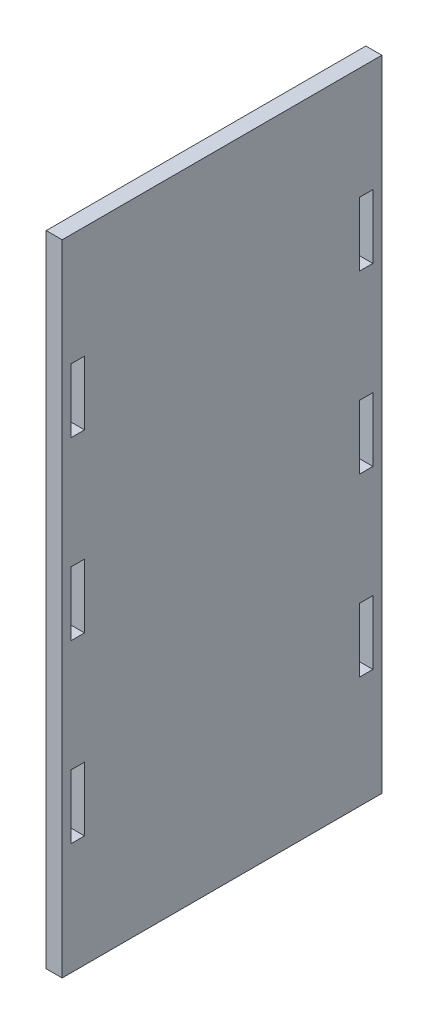
ISO-10303-21;
HEADER;
FILE_DESCRIPTION(('STEP AP214'),'2;1');
FILE_NAME('part.step','',(''),(''),'','','');
FILE_SCHEMA(('AUTOMOTIVE_DESIGN { 1 0 10303 214 1 1 1 1 }'));
ENDSEC;
DATA;
#1=APPLICATION_CONTEXT('core data for automotive mechanical design processes');
#2=APPLICATION_PROTOCOL_DEFINITION('international standard','automotive_design',2000,#1);
#3=PRODUCT_CONTEXT('',#1,'mechanical');
#4=PRODUCT('Part','Part','',(#3));
#5=PRODUCT_RELATED_PRODUCT_CATEGORY('part','',(#4));
#6=PRODUCT_DEFINITION_FORMATION('','',#4);
#7=PRODUCT_DEFINITION_CONTEXT('part definition',#1,'design');
#8=PRODUCT_DEFINITION('design','',#6,#7);
#9=PRODUCT_DEFINITION_SHAPE('','',#8);
#10=(LENGTH_UNIT() NAMED_UNIT(*) SI_UNIT(.MILLI.,.METRE.));
#11=(NAMED_UNIT(*) PLANE_ANGLE_UNIT() SI_UNIT($,.RADIAN.));
#12=(NAMED_UNIT(*) SI_UNIT($,.STERADIAN.) SOLID_ANGLE_UNIT());
#13=UNCERTAINTY_MEASURE_WITH_UNIT(LENGTH_MEASURE(1.E-05),#10,'distance_accuracy_value','');
#14=(GEOMETRIC_REPRESENTATION_CONTEXT(3) GLOBAL_UNCERTAINTY_ASSIGNED_CONTEXT((#13)) GLOBAL_UNIT_ASSIGNED_CONTEXT((#10,
#11,#12)) REPRESENTATION_CONTEXT('',''));
#15=CARTESIAN_POINT('',(0.,0.,0.));
#16=DIRECTION('',(0.,0.,1.));
#17=DIRECTION('',(1.,0.,0.));
#18=AXIS2_PLACEMENT_3D('',#15,#16,#17);
#19=CARTESIAN_POINT('',(0.,0.,0.));
#20=DIRECTION('',(1.,0.,0.));
#21=DIRECTION('',(0.,0.,-1.));
#22=AXIS2_PLACEMENT_3D('',#19,#20,#21);
#23=PLANE('',#22);
#24=DIRECTION('',(0.,0.,1.));
#25=VECTOR('',#24,1.);
#26=CARTESIAN_POINT('',(0.,-40.0000000000001,0.));
#27=LINE('',#26,#25);
#28=CARTESIAN_POINT('',(0.,-40.0000000000001,-47.2));
#29=VERTEX_POINT('',#28);
#30=CARTESIAN_POINT('',(0.,-40.0000000000001,-43.));
#31=VERTEX_POINT('',#30);
#32=EDGE_CURVE('E336',#29,#31,#27,.T.);
#33=ORIENTED_EDGE('',*,*,#32,.T.);
#34=DIRECTION('',(0.,1.,0.));
#35=VECTOR('',#34,1.);
#36=CARTESIAN_POINT('',(0.,0.,-43.));
#37=LINE('',#36,#35);
#38=CARTESIAN_POINT('',(0.,-60.0000000000001,-43.));
#39=VERTEX_POINT('',#38);
#40=EDGE_CURVE('E312',#39,#31,#37,.T.);
#41=ORIENTED_EDGE('',*,*,#40,.F.);
#42=DIRECTION('',(0.,0.,1.));
#43=VECTOR('',#42,1.);
#44=CARTESIAN_POINT('',(0.,-60.0000000000001,0.));
#45=LINE('',#44,#43);
#46=CARTESIAN_POINT('',(0.,-60.0000000000001,-47.2));
#47=VERTEX_POINT('',#46);
#48=EDGE_CURVE('E330',#47,#39,#45,.T.);
#49=ORIENTED_EDGE('',*,*,#48,.F.);
#50=DIRECTION('',(0.,1.,0.));
#51=VECTOR('',#50,1.);
#52=CARTESIAN_POINT('',(0.,0.,-47.2));
#53=LINE('',#52,#51);
#54=EDGE_CURVE('E332',#47,#29,#53,.T.);
#55=ORIENTED_EDGE('',*,*,#54,.T.);
#56=EDGE_LOOP('',(#33,#41,#49,#55));
#57=FACE_BOUND('',#56,.T.);
#58=DIRECTION('',(0.,1.,0.));
#59=VECTOR('',#58,1.);
#60=CARTESIAN_POINT('',(0.,0.,43.));
#61=LINE('',#60,#59);
#62=CARTESIAN_POINT('',(0.,-60.0000000000001,43.));
#63=VERTEX_POINT('',#62);
#64=CARTESIAN_POINT('',(0.,-40.0000000000001,43.));
#65=VERTEX_POINT('',#64);
#66=EDGE_CURVE('E237',#63,#65,#61,.T.);
#67=ORIENTED_EDGE('',*,*,#66,.T.);
#68=DIRECTION('',(0.,0.,-1.));
#69=VECTOR('',#68,1.);
#70=CARTESIAN_POINT('',(0.,-40.0000000000001,0.));
#71=LINE('',#70,#69);
#72=CARTESIAN_POINT('',(0.,-40.0000000000001,47.2));
#73=VERTEX_POINT('',#72);
#74=EDGE_CURVE('E267',#73,#65,#71,.T.);
#75=ORIENTED_EDGE('',*,*,#74,.F.);
#76=DIRECTION('',(0.,1.,0.));
#77=VECTOR('',#76,1.);
#78=CARTESIAN_POINT('',(0.,0.,47.2));
#79=LINE('',#78,#77);
#80=CARTESIAN_POINT('',(0.,-60.0000000000001,47.2));
#81=VERTEX_POINT('',#80);
#82=EDGE_CURVE('E487',#81,#73,#79,.T.);
#83=ORIENTED_EDGE('',*,*,#82,.F.);
#84=DIRECTION('',(0.,0.,-1.));
#85=VECTOR('',#84,1.);
#86=CARTESIAN_POINT('',(0.,-60.0000000000001,0.));
#87=LINE('',#86,#85);
#88=EDGE_CURVE('E401',#81,#63,#87,.T.);
#89=ORIENTED_EDGE('',*,*,#88,.T.);
#90=EDGE_LOOP('',(#67,#75,#83,#89));
#91=FACE_BOUND('',#90,.T.);
#92=DIRECTION('',(0.,0.,1.));
#93=VECTOR('',#92,1.);
#94=CARTESIAN_POINT('',(0.,-150.,-50.));
#95=LINE('',#94,#93);
#96=CARTESIAN_POINT('',(0.,-150.,-50.));
#97=VERTEX_POINT('',#96);
#98=CARTESIAN_POINT('',(0.,-150.,50.));
#99=VERTEX_POINT('',#98);
#100=EDGE_CURVE('E396',#97,#99,#95,.T.);
#101=ORIENTED_EDGE('',*,*,#100,.T.);
#102=DIRECTION('',(0.,1.,0.));
#103=VECTOR('',#102,1.);
#104=CARTESIAN_POINT('',(0.,50.,50.));
#105=LINE('',#104,#103);
#106=CARTESIAN_POINT('',(0.,50.,50.));
#107=VERTEX_POINT('',#106);
#108=EDGE_CURVE('E422',#99,#107,#105,.T.);
#109=ORIENTED_EDGE('',*,*,#108,.T.);
#110=DIRECTION('',(0.,0.,-1.));
#111=VECTOR('',#110,1.);
#112=CARTESIAN_POINT('',(0.,50.,-50.));
#113=LINE('',#112,#111);
#114=CARTESIAN_POINT('',(0.,50.,-50.));
#115=VERTEX_POINT('',#114);
#116=EDGE_CURVE('E427',#107,#115,#113,.T.);
#117=ORIENTED_EDGE('',*,*,#116,.T.);
#118=DIRECTION('',(0.,-1.,0.));
#119=VECTOR('',#118,1.);
#120=CARTESIAN_POINT('',(0.,-50.,-50.));
#121=LINE('',#120,#119);
#122=EDGE_CURVE('E423',#115,#97,#121,.T.);
#123=ORIENTED_EDGE('',*,*,#122,.T.);
#124=EDGE_LOOP('',(#101,#109,#117,#123));
#125=FACE_BOUND('',#124,.T.);
#126=DIRECTION('',(0.,1.,0.));
#127=VECTOR('',#126,1.);
#128=CARTESIAN_POINT('',(0.,0.,43.));
#129=LINE('',#128,#127);
#130=CARTESIAN_POINT('',(0.,-5.00000000000005,43.));
#131=VERTEX_POINT('',#130);
#132=CARTESIAN_POINT('',(0.,15.,43.));
#133=VERTEX_POINT('',#132);
#134=EDGE_CURVE('E391',#131,#133,#129,.T.);
#135=ORIENTED_EDGE('',*,*,#134,.T.);
#136=DIRECTION('',(0.,0.,-1.));
#137=VECTOR('',#136,1.);
#138=CARTESIAN_POINT('',(0.,14.9999999999999,0.));
#139=LINE('',#138,#137);
#140=CARTESIAN_POINT('',(0.,15.,47.2));
#141=VERTEX_POINT('',#140);
#142=EDGE_CURVE('E388',#141,#133,#139,.T.);
#143=ORIENTED_EDGE('',*,*,#142,.F.);
#144=DIRECTION('',(0.,1.,0.));
#145=VECTOR('',#144,1.);
#146=CARTESIAN_POINT('',(0.,0.,47.2));
#147=LINE('',#146,#145);
#148=CARTESIAN_POINT('',(0.,-5.00000000000005,47.2));
#149=VERTEX_POINT('',#148);
#150=EDGE_CURVE('E390',#149,#141,#147,.T.);
#151=ORIENTED_EDGE('',*,*,#150,.F.);
#152=DIRECTION('',(0.,0.,-1.));
#153=VECTOR('',#152,1.);
#154=CARTESIAN_POINT('',(0.,-5.00000000000004,0.));
#155=LINE('',#154,#153);
#156=EDGE_CURVE('E393',#149,#131,#155,.T.);
#157=ORIENTED_EDGE('',*,*,#156,.T.);
#158=EDGE_LOOP('',(#135,#143,#151,#157));
#159=FACE_BOUND('',#158,.T.);
#160=DIRECTION('',(0.,0.,-1.));
#161=VECTOR('',#160,1.);
#162=CARTESIAN_POINT('',(0.,-115.,0.));
#163=LINE('',#162,#161);
#164=CARTESIAN_POINT('',(0.,-115.,47.2));
#165=VERTEX_POINT('',#164);
#166=CARTESIAN_POINT('',(0.,-115.,43.));
#167=VERTEX_POINT('',#166);
#168=EDGE_CURVE('E271',#165,#167,#163,.T.);
#169=ORIENTED_EDGE('',*,*,#168,.T.);
#170=DIRECTION('',(0.,-1.,0.));
#171=VECTOR('',#170,1.);
#172=CARTESIAN_POINT('',(0.,0.,43.));
#173=LINE('',#172,#171);
#174=CARTESIAN_POINT('',(0.,-95.0000000000001,43.));
#175=VERTEX_POINT('',#174);
#176=EDGE_CURVE('E275',#175,#167,#173,.T.);
#177=ORIENTED_EDGE('',*,*,#176,.F.);
#178=DIRECTION('',(0.,0.,-1.));
#179=VECTOR('',#178,1.);
#180=CARTESIAN_POINT('',(0.,-95.0000000000002,3.13902343271994E-13));
#181=LINE('',#180,#179);
#182=CARTESIAN_POINT('',(0.,-95.0000000000001,47.2));
#183=VERTEX_POINT('',#182);
#184=EDGE_CURVE('E251',#183,#175,#181,.T.);
#185=ORIENTED_EDGE('',*,*,#184,.F.);
#186=DIRECTION('',(0.,1.,0.));
#187=VECTOR('',#186,1.);
#188=CARTESIAN_POINT('',(0.,0.,47.2));
#189=LINE('',#188,#187);
#190=EDGE_CURVE('E268',#165,#183,#189,.T.);
#191=ORIENTED_EDGE('',*,*,#190,.F.);
#192=EDGE_LOOP('',(#169,#177,#185,#191));
#193=FACE_BOUND('',#192,.T.);
#194=DIRECTION('',(0.,0.,1.));
#195=VECTOR('',#194,1.);
#196=CARTESIAN_POINT('',(0.,-95.0000000000002,-3.13902343271994E-13));
#197=LINE('',#196,#195);
#198=CARTESIAN_POINT('',(0.,-95.0000000000001,-47.2));
#199=VERTEX_POINT('',#198);
#200=CARTESIAN_POINT('',(0.,-95.0000000000001,-43.));
#201=VERTEX_POINT('',#200);
#202=EDGE_CURVE('E305',#199,#201,#197,.T.);
#203=ORIENTED_EDGE('',*,*,#202,.T.);
#204=DIRECTION('',(0.,1.,0.));
#205=VECTOR('',#204,1.);
#206=CARTESIAN_POINT('',(0.,0.,-43.));
#207=LINE('',#206,#205);
#208=CARTESIAN_POINT('',(0.,-115.,-43.));
#209=VERTEX_POINT('',#208);
#210=EDGE_CURVE('E280',#209,#201,#207,.T.);
#211=ORIENTED_EDGE('',*,*,#210,.F.);
#212=DIRECTION('',(0.,0.,1.));
#213=VECTOR('',#212,1.);
#214=CARTESIAN_POINT('',(0.,-115.,0.));
#215=LINE('',#214,#213);
#216=CARTESIAN_POINT('',(0.,-115.,-47.2));
#217=VERTEX_POINT('',#216);
#218=EDGE_CURVE('E298',#217,#209,#215,.T.);
#219=ORIENTED_EDGE('',*,*,#218,.F.);
#220=DIRECTION('',(0.,1.,0.));
#221=VECTOR('',#220,1.);
#222=CARTESIAN_POINT('',(0.,0.,-47.2));
#223=LINE('',#222,#221);
#224=EDGE_CURVE('E301',#217,#199,#223,.T.);
#225=ORIENTED_EDGE('',*,*,#224,.T.);
#226=EDGE_LOOP('',(#203,#211,#219,#225));
#227=FACE_BOUND('',#226,.T.);
#228=DIRECTION('',(0.,0.,1.));
#229=VECTOR('',#228,1.);
#230=CARTESIAN_POINT('',(0.,14.9999999999999,0.));
#231=LINE('',#230,#229);
#232=CARTESIAN_POINT('',(0.,14.9999999999999,-47.2));
#233=VERTEX_POINT('',#232);
#234=CARTESIAN_POINT('',(0.,14.9999999999999,-43.));
#235=VERTEX_POINT('',#234);
#236=EDGE_CURVE('E363',#233,#235,#231,.T.);
#237=ORIENTED_EDGE('',*,*,#236,.T.);
#238=DIRECTION('',(0.,-1.,0.));
#239=VECTOR('',#238,1.);
#240=CARTESIAN_POINT('',(0.,0.,-43.));
#241=LINE('',#240,#239);
#242=CARTESIAN_POINT('',(0.,-5.00000000000006,-43.));
#243=VERTEX_POINT('',#242);
#244=EDGE_CURVE('E359',#235,#243,#241,.T.);
#245=ORIENTED_EDGE('',*,*,#244,.T.);
#246=DIRECTION('',(0.,0.,1.));
#247=VECTOR('',#246,1.);
#248=CARTESIAN_POINT('',(0.,-5.00000000000006,0.));
#249=LINE('',#248,#247);
#250=CARTESIAN_POINT('',(0.,-5.00000000000007,-47.2));
#251=VERTEX_POINT('',#250);
#252=EDGE_CURVE('E362',#251,#243,#249,.T.);
#253=ORIENTED_EDGE('',*,*,#252,.F.);
#254=DIRECTION('',(0.,1.,0.));
#255=VECTOR('',#254,1.);
#256=CARTESIAN_POINT('',(0.,0.,-47.2));
#257=LINE('',#256,#255);
#258=EDGE_CURVE('E343',#251,#233,#257,.T.);
#259=ORIENTED_EDGE('',*,*,#258,.T.);
#260=EDGE_LOOP('',(#237,#245,#253,#259));
#261=FACE_BOUND('',#260,.T.);
#262=ADVANCED_FACE('F44',(#57,#91,#125,#159,#193,#227,#261),#23,.F.);
#263=CARTESIAN_POINT('',(5.,0.,0.));
#264=DIRECTION('',(1.,0.,0.));
#265=DIRECTION('',(0.,0.,-1.));
#266=AXIS2_PLACEMENT_3D('',#263,#264,#265);
#267=PLANE('',#266);
#268=DIRECTION('',(0.,1.,0.));
#269=VECTOR('',#268,1.);
#270=CARTESIAN_POINT('',(5.,0.,43.));
#271=LINE('',#270,#269);
#272=CARTESIAN_POINT('',(5.,-115.,43.));
#273=VERTEX_POINT('',#272);
#274=CARTESIAN_POINT('',(5.,-95.0000000000001,43.));
#275=VERTEX_POINT('',#274);
#276=EDGE_CURVE('E277',#273,#275,#271,.T.);
#277=ORIENTED_EDGE('',*,*,#276,.F.);
#278=DIRECTION('',(0.,0.,1.));
#279=VECTOR('',#278,1.);
#280=CARTESIAN_POINT('',(5.,-115.,0.));
#281=LINE('',#280,#279);
#282=CARTESIAN_POINT('',(5.,-115.,47.2));
#283=VERTEX_POINT('',#282);
#284=EDGE_CURVE('E286',#273,#283,#281,.T.);
#285=ORIENTED_EDGE('',*,*,#284,.T.);
#286=DIRECTION('',(0.,-1.,0.));
#287=VECTOR('',#286,1.);
#288=CARTESIAN_POINT('',(5.,0.,47.2));
#289=LINE('',#288,#287);
#290=CARTESIAN_POINT('',(5.,-95.0000000000001,47.2));
#291=VERTEX_POINT('',#290);
#292=EDGE_CURVE('E283',#291,#283,#289,.T.);
#293=ORIENTED_EDGE('',*,*,#292,.F.);
#294=DIRECTION('',(0.,0.,1.));
#295=VECTOR('',#294,1.);
#296=CARTESIAN_POINT('',(5.,-95.0000000000002,3.13902343271994E-13));
#297=LINE('',#296,#295);
#298=EDGE_CURVE('E279',#275,#291,#297,.T.);
#299=ORIENTED_EDGE('',*,*,#298,.F.);
#300=EDGE_LOOP('',(#277,#285,#293,#299));
#301=FACE_BOUND('',#300,.T.);
#302=DIRECTION('',(0.,0.,1.));
#303=VECTOR('',#302,1.);
#304=CARTESIAN_POINT('',(5.,-150.,-50.));
#305=LINE('',#304,#303);
#306=CARTESIAN_POINT('',(5.,-150.,-50.));
#307=VERTEX_POINT('',#306);
#308=CARTESIAN_POINT('',(5.,-150.,50.));
#309=VERTEX_POINT('',#308);
#310=EDGE_CURVE('E52',#307,#309,#305,.T.);
#311=ORIENTED_EDGE('',*,*,#310,.F.);
#312=DIRECTION('',(0.,-1.,0.));
#313=VECTOR('',#312,1.);
#314=CARTESIAN_POINT('',(5.,-50.,-50.));
#315=LINE('',#314,#313);
#316=CARTESIAN_POINT('',(5.,50.,-50.));
#317=VERTEX_POINT('',#316);
#318=EDGE_CURVE('E437',#317,#307,#315,.T.);
#319=ORIENTED_EDGE('',*,*,#318,.F.);
#320=DIRECTION('',(0.,0.,-1.));
#321=VECTOR('',#320,1.);
#322=CARTESIAN_POINT('',(5.,50.,-50.));
#323=LINE('',#322,#321);
#324=CARTESIAN_POINT('',(5.,50.,50.));
#325=VERTEX_POINT('',#324);
#326=EDGE_CURVE('E441',#325,#317,#323,.T.);
#327=ORIENTED_EDGE('',*,*,#326,.F.);
#328=DIRECTION('',(0.,1.,0.));
#329=VECTOR('',#328,1.);
#330=CARTESIAN_POINT('',(5.,50.,50.));
#331=LINE('',#330,#329);
#332=EDGE_CURVE('E426',#309,#325,#331,.T.);
#333=ORIENTED_EDGE('',*,*,#332,.F.);
#334=EDGE_LOOP('',(#311,#319,#327,#333));
#335=FACE_BOUND('',#334,.T.);
#336=DIRECTION('',(0.,0.,1.));
#337=VECTOR('',#336,1.);
#338=CARTESIAN_POINT('',(5.,14.9999999999999,0.));
#339=LINE('',#338,#337);
#340=CARTESIAN_POINT('',(5.,15.,43.));
#341=VERTEX_POINT('',#340);
#342=CARTESIAN_POINT('',(5.,15.,47.2));
#343=VERTEX_POINT('',#342);
#344=EDGE_CURVE('E404',#341,#343,#339,.T.);
#345=ORIENTED_EDGE('',*,*,#344,.F.);
#346=DIRECTION('',(0.,-1.,0.));
#347=VECTOR('',#346,1.);
#348=CARTESIAN_POINT('',(5.,0.,43.));
#349=LINE('',#348,#347);
#350=CARTESIAN_POINT('',(5.,-5.00000000000005,43.));
#351=VERTEX_POINT('',#350);
#352=EDGE_CURVE('E400',#341,#351,#349,.T.);
#353=ORIENTED_EDGE('',*,*,#352,.T.);
#354=DIRECTION('',(0.,0.,1.));
#355=VECTOR('',#354,1.);
#356=CARTESIAN_POINT('',(5.,-5.00000000000004,0.));
#357=LINE('',#356,#355);
#358=CARTESIAN_POINT('',(5.,-5.00000000000005,47.2));
#359=VERTEX_POINT('',#358);
#360=EDGE_CURVE('E397',#351,#359,#357,.T.);
#361=ORIENTED_EDGE('',*,*,#360,.T.);
#362=DIRECTION('',(0.,-1.,0.));
#363=VECTOR('',#362,1.);
#364=CARTESIAN_POINT('',(5.,0.,47.2));
#365=LINE('',#364,#363);
#366=EDGE_CURVE('E407',#343,#359,#365,.T.);
#367=ORIENTED_EDGE('',*,*,#366,.F.);
#368=EDGE_LOOP('',(#345,#353,#361,#367));
#369=FACE_BOUND('',#368,.T.);
#370=DIRECTION('',(0.,0.,1.));
#371=VECTOR('',#370,1.);
#372=CARTESIAN_POINT('',(5.,-40.0000000000001,0.));
#373=LINE('',#372,#371);
#374=CARTESIAN_POINT('',(5.,-40.0000000000001,43.));
#375=VERTEX_POINT('',#374);
#376=CARTESIAN_POINT('',(5.,-40.0000000000001,47.2));
#377=VERTEX_POINT('',#376);
#378=EDGE_CURVE('E256',#375,#377,#373,.T.);
#379=ORIENTED_EDGE('',*,*,#378,.F.);
#380=DIRECTION('',(0.,-1.,0.));
#381=VECTOR('',#380,1.);
#382=CARTESIAN_POINT('',(5.,0.,43.));
#383=LINE('',#382,#381);
#384=CARTESIAN_POINT('',(5.,-60.0000000000001,43.));
#385=VERTEX_POINT('',#384);
#386=EDGE_CURVE('E234',#375,#385,#383,.T.);
#387=ORIENTED_EDGE('',*,*,#386,.T.);
#388=DIRECTION('',(0.,0.,1.));
#389=VECTOR('',#388,1.);
#390=CARTESIAN_POINT('',(5.,-60.0000000000001,0.));
#391=LINE('',#390,#389);
#392=CARTESIAN_POINT('',(5.,-60.0000000000001,47.2));
#393=VERTEX_POINT('',#392);
#394=EDGE_CURVE('E245',#385,#393,#391,.T.);
#395=ORIENTED_EDGE('',*,*,#394,.T.);
#396=DIRECTION('',(0.,-1.,0.));
#397=VECTOR('',#396,1.);
#398=CARTESIAN_POINT('',(5.,0.,47.2));
#399=LINE('',#398,#397);
#400=EDGE_CURVE('E241',#377,#393,#399,.T.);
#401=ORIENTED_EDGE('',*,*,#400,.F.);
#402=EDGE_LOOP('',(#379,#387,#395,#401));
#403=FACE_BOUND('',#402,.T.);
#404=DIRECTION('',(0.,-1.,0.));
#405=VECTOR('',#404,1.);
#406=CARTESIAN_POINT('',(5.,0.,-43.));
#407=LINE('',#406,#405);
#408=CARTESIAN_POINT('',(5.,-95.0000000000001,-43.));
#409=VERTEX_POINT('',#408);
#410=CARTESIAN_POINT('',(5.,-115.,-43.));
#411=VERTEX_POINT('',#410);
#412=EDGE_CURVE('E311',#409,#411,#407,.T.);
#413=ORIENTED_EDGE('',*,*,#412,.F.);
#414=DIRECTION('',(0.,0.,-1.));
#415=VECTOR('',#414,1.);
#416=CARTESIAN_POINT('',(5.,-95.0000000000002,-3.13902343271994E-13));
#417=LINE('',#416,#415);
#418=CARTESIAN_POINT('',(5.,-95.0000000000001,-47.2));
#419=VERTEX_POINT('',#418);
#420=EDGE_CURVE('E308',#409,#419,#417,.T.);
#421=ORIENTED_EDGE('',*,*,#420,.T.);
#422=DIRECTION('',(0.,-1.,0.));
#423=VECTOR('',#422,1.);
#424=CARTESIAN_POINT('',(5.,0.,-47.2));
#425=LINE('',#424,#423);
#426=CARTESIAN_POINT('',(5.,-115.,-47.2));
#427=VERTEX_POINT('',#426);
#428=EDGE_CURVE('E318',#419,#427,#425,.T.);
#429=ORIENTED_EDGE('',*,*,#428,.T.);
#430=DIRECTION('',(0.,0.,-1.));
#431=VECTOR('',#430,1.);
#432=CARTESIAN_POINT('',(5.,-115.,0.));
#433=LINE('',#432,#431);
#434=EDGE_CURVE('E315',#411,#427,#433,.T.);
#435=ORIENTED_EDGE('',*,*,#434,.F.);
#436=EDGE_LOOP('',(#413,#421,#429,#435));
#437=FACE_BOUND('',#436,.T.);
#438=DIRECTION('',(0.,-1.,0.));
#439=VECTOR('',#438,1.);
#440=CARTESIAN_POINT('',(5.,0.,-43.));
#441=LINE('',#440,#439);
#442=CARTESIAN_POINT('',(5.,-40.0000000000001,-43.));
#443=VERTEX_POINT('',#442);
#444=CARTESIAN_POINT('',(5.,-60.0000000000001,-43.));
#445=VERTEX_POINT('',#444);
#446=EDGE_CURVE('E342',#443,#445,#441,.T.);
#447=ORIENTED_EDGE('',*,*,#446,.F.);
#448=DIRECTION('',(0.,0.,-1.));
#449=VECTOR('',#448,1.);
#450=CARTESIAN_POINT('',(5.,-40.0000000000001,0.));
#451=LINE('',#450,#449);
#452=CARTESIAN_POINT('',(5.,-40.0000000000001,-47.2));
#453=VERTEX_POINT('',#452);
#454=EDGE_CURVE('E339',#443,#453,#451,.T.);
#455=ORIENTED_EDGE('',*,*,#454,.T.);
#456=DIRECTION('',(0.,-1.,0.));
#457=VECTOR('',#456,1.);
#458=CARTESIAN_POINT('',(5.,0.,-47.2));
#459=LINE('',#458,#457);
#460=CARTESIAN_POINT('',(5.,-60.0000000000001,-47.2));
#461=VERTEX_POINT('',#460);
#462=EDGE_CURVE('E348',#453,#461,#459,.T.);
#463=ORIENTED_EDGE('',*,*,#462,.T.);
#464=DIRECTION('',(0.,0.,-1.));
#465=VECTOR('',#464,1.);
#466=CARTESIAN_POINT('',(5.,-60.0000000000001,0.));
#467=LINE('',#466,#465);
#468=EDGE_CURVE('E345',#445,#461,#467,.T.);
#469=ORIENTED_EDGE('',*,*,#468,.F.);
#470=EDGE_LOOP('',(#447,#455,#463,#469));
#471=FACE_BOUND('',#470,.T.);
#472=DIRECTION('',(0.,1.,0.));
#473=VECTOR('',#472,1.);
#474=CARTESIAN_POINT('',(5.,0.,-43.));
#475=LINE('',#474,#473);
#476=CARTESIAN_POINT('',(5.,-5.00000000000006,-43.));
#477=VERTEX_POINT('',#476);
#478=CARTESIAN_POINT('',(5.,14.9999999999999,-43.));
#479=VERTEX_POINT('',#478);
#480=EDGE_CURVE('E373',#477,#479,#475,.T.);
#481=ORIENTED_EDGE('',*,*,#480,.T.);
#482=DIRECTION('',(0.,0.,-1.));
#483=VECTOR('',#482,1.);
#484=CARTESIAN_POINT('',(5.,14.9999999999999,0.));
#485=LINE('',#484,#483);
#486=CARTESIAN_POINT('',(5.,14.9999999999999,-47.2));
#487=VERTEX_POINT('',#486);
#488=EDGE_CURVE('E370',#479,#487,#485,.T.);
#489=ORIENTED_EDGE('',*,*,#488,.T.);
#490=DIRECTION('',(0.,-1.,0.));
#491=VECTOR('',#490,1.);
#492=CARTESIAN_POINT('',(5.,0.,-47.2));
#493=LINE('',#492,#491);
#494=CARTESIAN_POINT('',(5.,-5.00000000000007,-47.2));
#495=VERTEX_POINT('',#494);
#496=EDGE_CURVE('E367',#487,#495,#493,.T.);
#497=ORIENTED_EDGE('',*,*,#496,.T.);
#498=DIRECTION('',(0.,0.,-1.));
#499=VECTOR('',#498,1.);
#500=CARTESIAN_POINT('',(5.,-5.00000000000006,0.));
#501=LINE('',#500,#499);
#502=EDGE_CURVE('E376',#477,#495,#501,.T.);
#503=ORIENTED_EDGE('',*,*,#502,.F.);
#504=EDGE_LOOP('',(#481,#489,#497,#503));
#505=FACE_BOUND('',#504,.T.);
#506=ADVANCED_FACE('F253',(#301,#335,#369,#403,#437,#471,#505),#267,.T.);
#507=CARTESIAN_POINT('',(228.606797749979,50.,50.));
#508=DIRECTION('',(0.,0.,1.));
#509=DIRECTION('',(1.,0.,0.));
#510=AXIS2_PLACEMENT_3D('',#507,#508,#509);
#511=PLANE('',#510);
#512=DIRECTION('',(-1.,0.,0.));
#513=VECTOR('',#512,1.);
#514=CARTESIAN_POINT('',(228.606797749979,-150.,50.));
#515=LINE('',#514,#513);
#516=EDGE_CURVE('E11',#309,#99,#515,.T.);
#517=ORIENTED_EDGE('',*,*,#516,.F.);
#518=ORIENTED_EDGE('',*,*,#332,.T.);
#519=DIRECTION('',(-1.,0.,0.));
#520=VECTOR('',#519,1.);
#521=CARTESIAN_POINT('',(228.606797749979,50.,50.));
#522=LINE('',#521,#520);
#523=EDGE_CURVE('E47',#325,#107,#522,.T.);
#524=ORIENTED_EDGE('',*,*,#523,.T.);
#525=ORIENTED_EDGE('',*,*,#108,.F.);
#526=EDGE_LOOP('',(#517,#518,#524,#525));
#527=FACE_BOUND('',#526,.T.);
#528=ADVANCED_FACE('F459',(#527),#511,.T.);
#529=CARTESIAN_POINT('',(228.606797749979,50.,-50.));
#530=DIRECTION('',(0.,1.,0.));
#531=DIRECTION('',(0.,0.,1.));
#532=AXIS2_PLACEMENT_3D('',#529,#530,#531);
#533=PLANE('',#532);
#534=ORIENTED_EDGE('',*,*,#523,.F.);
#535=ORIENTED_EDGE('',*,*,#326,.T.);
#536=DIRECTION('',(-1.,0.,0.));
#537=VECTOR('',#536,1.);
#538=CARTESIAN_POINT('',(228.606797749979,50.,-50.));
#539=LINE('',#538,#537);
#540=EDGE_CURVE('E440',#317,#115,#539,.T.);
#541=ORIENTED_EDGE('',*,*,#540,.T.);
#542=ORIENTED_EDGE('',*,*,#116,.F.);
#543=EDGE_LOOP('',(#534,#535,#541,#542));
#544=FACE_BOUND('',#543,.T.);
#545=ADVANCED_FACE('F449',(#544),#533,.T.);
#546=CARTESIAN_POINT('',(228.606797749979,-50.,-50.));
#547=DIRECTION('',(0.,0.,-1.));
#548=DIRECTION('',(0.,1.,0.));
#549=AXIS2_PLACEMENT_3D('',#546,#547,#548);
#550=PLANE('',#549);
#551=ORIENTED_EDGE('',*,*,#540,.F.);
#552=ORIENTED_EDGE('',*,*,#318,.T.);
#553=DIRECTION('',(-1.,0.,0.));
#554=VECTOR('',#553,1.);
#555=CARTESIAN_POINT('',(228.606797749979,-150.,-50.));
#556=LINE('',#555,#554);
#557=EDGE_CURVE('E436',#307,#97,#556,.T.);
#558=ORIENTED_EDGE('',*,*,#557,.T.);
#559=ORIENTED_EDGE('',*,*,#122,.F.);
#560=EDGE_LOOP('',(#551,#552,#558,#559));
#561=FACE_BOUND('',#560,.T.);
#562=ADVANCED_FACE('F451',(#561),#550,.T.);
#563=CARTESIAN_POINT('',(228.606797749979,-150.,-50.));
#564=DIRECTION('',(0.,-1.,0.));
#565=DIRECTION('',(0.,0.,-1.));
#566=AXIS2_PLACEMENT_3D('',#563,#564,#565);
#567=PLANE('',#566);
#568=ORIENTED_EDGE('',*,*,#557,.F.);
#569=ORIENTED_EDGE('',*,*,#310,.T.);
#570=ORIENTED_EDGE('',*,*,#516,.T.);
#571=ORIENTED_EDGE('',*,*,#100,.F.);
#572=EDGE_LOOP('',(#568,#569,#570,#571));
#573=FACE_BOUND('',#572,.T.);
#574=ADVANCED_FACE('F463',(#573),#567,.T.);
#575=CARTESIAN_POINT('',(-20.4362423160424,0.,43.));
#576=DIRECTION('',(0.,0.,1.));
#577=DIRECTION('',(1.,0.,0.));
#578=AXIS2_PLACEMENT_3D('',#575,#576,#577);
#579=PLANE('',#578);
#580=DIRECTION('',(1.,0.,0.));
#581=VECTOR('',#580,1.);
#582=CARTESIAN_POINT('',(-20.4362423160424,-5.00000000000005,43.));
#583=LINE('',#582,#581);
#584=EDGE_CURVE('E409',#131,#351,#583,.T.);
#585=ORIENTED_EDGE('',*,*,#584,.T.);
#586=ORIENTED_EDGE('',*,*,#352,.F.);
#587=DIRECTION('',(1.,0.,0.));
#588=VECTOR('',#587,1.);
#589=CARTESIAN_POINT('',(-20.4362423160424,15.,43.));
#590=LINE('',#589,#588);
#591=EDGE_CURVE('E415',#133,#341,#590,.T.);
#592=ORIENTED_EDGE('',*,*,#591,.F.);
#593=ORIENTED_EDGE('',*,*,#134,.F.);
#594=EDGE_LOOP('',(#585,#586,#592,#593));
#595=FACE_BOUND('',#594,.T.);
#596=ADVANCED_FACE('F465',(#595),#579,.T.);
#597=CARTESIAN_POINT('',(-20.4362423160424,14.9999999999999,0.));
#598=DIRECTION('',(0.,1.,0.));
#599=DIRECTION('',(0.,0.,1.));
#600=AXIS2_PLACEMENT_3D('',#597,#598,#599);
#601=PLANE('',#600);
#602=ORIENTED_EDGE('',*,*,#142,.T.);
#603=ORIENTED_EDGE('',*,*,#591,.T.);
#604=ORIENTED_EDGE('',*,*,#344,.T.);
#605=DIRECTION('',(1.,0.,0.));
#606=VECTOR('',#605,1.);
#607=CARTESIAN_POINT('',(-20.4362423160424,15.,47.2));
#608=LINE('',#607,#606);
#609=EDGE_CURVE('E413',#141,#343,#608,.T.);
#610=ORIENTED_EDGE('',*,*,#609,.F.);
#611=EDGE_LOOP('',(#602,#603,#604,#610));
#612=FACE_BOUND('',#611,.T.);
#613=ADVANCED_FACE('F472',(#612),#601,.F.);
#614=CARTESIAN_POINT('',(-20.4362423160424,0.,47.2));
#615=DIRECTION('',(0.,0.,1.));
#616=DIRECTION('',(1.,0.,0.));
#617=AXIS2_PLACEMENT_3D('',#614,#615,#616);
#618=PLANE('',#617);
#619=ORIENTED_EDGE('',*,*,#150,.T.);
#620=ORIENTED_EDGE('',*,*,#609,.T.);
#621=ORIENTED_EDGE('',*,*,#366,.T.);
#622=DIRECTION('',(1.,0.,0.));
#623=VECTOR('',#622,1.);
#624=CARTESIAN_POINT('',(-20.4362423160424,-5.00000000000005,47.2));
#625=LINE('',#624,#623);
#626=EDGE_CURVE('E410',#149,#359,#625,.T.);
#627=ORIENTED_EDGE('',*,*,#626,.F.);
#628=EDGE_LOOP('',(#619,#620,#621,#627));
#629=FACE_BOUND('',#628,.T.);
#630=ADVANCED_FACE('F569',(#629),#618,.F.);
#631=CARTESIAN_POINT('',(-20.4362423160424,-5.00000000000004,0.));
#632=DIRECTION('',(0.,1.,0.));
#633=DIRECTION('',(0.,0.,1.));
#634=AXIS2_PLACEMENT_3D('',#631,#632,#633);
#635=PLANE('',#634);
#636=ORIENTED_EDGE('',*,*,#626,.T.);
#637=ORIENTED_EDGE('',*,*,#360,.F.);
#638=ORIENTED_EDGE('',*,*,#584,.F.);
#639=ORIENTED_EDGE('',*,*,#156,.F.);
#640=EDGE_LOOP('',(#636,#637,#638,#639));
#641=FACE_BOUND('',#640,.T.);
#642=ADVANCED_FACE('F506',(#641),#635,.T.);
#643=CARTESIAN_POINT('',(-20.4362423160424,0.,43.));
#644=DIRECTION('',(0.,0.,1.));
#645=DIRECTION('',(1.,0.,0.));
#646=AXIS2_PLACEMENT_3D('',#643,#644,#645);
#647=PLANE('',#646);
#648=DIRECTION('',(1.,0.,0.));
#649=VECTOR('',#648,1.);
#650=CARTESIAN_POINT('',(-20.4362423160424,-60.0000000000001,43.));
#651=LINE('',#650,#649);
#652=EDGE_CURVE('E229',#63,#385,#651,.T.);
#653=ORIENTED_EDGE('',*,*,#652,.T.);
#654=ORIENTED_EDGE('',*,*,#386,.F.);
#655=DIRECTION('',(1.,0.,0.));
#656=VECTOR('',#655,1.);
#657=CARTESIAN_POINT('',(-20.4362423160424,-40.0000000000001,43.));
#658=LINE('',#657,#656);
#659=EDGE_CURVE('E240',#65,#375,#658,.T.);
#660=ORIENTED_EDGE('',*,*,#659,.F.);
#661=ORIENTED_EDGE('',*,*,#66,.F.);
#662=EDGE_LOOP('',(#653,#654,#660,#661));
#663=FACE_BOUND('',#662,.T.);
#664=ADVANCED_FACE('F231',(#663),#647,.T.);
#665=CARTESIAN_POINT('',(-20.4362423160424,-40.0000000000001,0.));
#666=DIRECTION('',(0.,1.,0.));
#667=DIRECTION('',(0.,0.,1.));
#668=AXIS2_PLACEMENT_3D('',#665,#666,#667);
#669=PLANE('',#668);
#670=ORIENTED_EDGE('',*,*,#74,.T.);
#671=ORIENTED_EDGE('',*,*,#659,.T.);
#672=ORIENTED_EDGE('',*,*,#378,.T.);
#673=DIRECTION('',(1.,0.,0.));
#674=VECTOR('',#673,1.);
#675=CARTESIAN_POINT('',(-20.4362423160424,-40.0000000000001,47.2));
#676=LINE('',#675,#674);
#677=EDGE_CURVE('E263',#73,#377,#676,.T.);
#678=ORIENTED_EDGE('',*,*,#677,.F.);
#679=EDGE_LOOP('',(#670,#671,#672,#678));
#680=FACE_BOUND('',#679,.T.);
#681=ADVANCED_FACE('F492',(#680),#669,.F.);
#682=CARTESIAN_POINT('',(-20.4362423160424,0.,47.2));
#683=DIRECTION('',(0.,0.,1.));
#684=DIRECTION('',(1.,0.,0.));
#685=AXIS2_PLACEMENT_3D('',#682,#683,#684);
#686=PLANE('',#685);
#687=ORIENTED_EDGE('',*,*,#82,.T.);
#688=ORIENTED_EDGE('',*,*,#677,.T.);
#689=ORIENTED_EDGE('',*,*,#400,.T.);
#690=DIRECTION('',(1.,0.,0.));
#691=VECTOR('',#690,1.);
#692=CARTESIAN_POINT('',(-20.4362423160424,-60.0000000000001,47.2));
#693=LINE('',#692,#691);
#694=EDGE_CURVE('E248',#81,#393,#693,.T.);
#695=ORIENTED_EDGE('',*,*,#694,.F.);
#696=EDGE_LOOP('',(#687,#688,#689,#695));
#697=FACE_BOUND('',#696,.T.);
#698=ADVANCED_FACE('F494',(#697),#686,.F.);
#699=CARTESIAN_POINT('',(-20.4362423160424,-60.0000000000001,0.));
#700=DIRECTION('',(0.,1.,0.));
#701=DIRECTION('',(0.,0.,1.));
#702=AXIS2_PLACEMENT_3D('',#699,#700,#701);
#703=PLANE('',#702);
#704=ORIENTED_EDGE('',*,*,#694,.T.);
#705=ORIENTED_EDGE('',*,*,#394,.F.);
#706=ORIENTED_EDGE('',*,*,#652,.F.);
#707=ORIENTED_EDGE('',*,*,#88,.F.);
#708=EDGE_LOOP('',(#704,#705,#706,#707));
#709=FACE_BOUND('',#708,.T.);
#710=ADVANCED_FACE('F246',(#709),#703,.T.);
#711=CARTESIAN_POINT('',(-20.4362423160424,0.,43.));
#712=DIRECTION('',(0.,0.,-1.));
#713=DIRECTION('',(-1.,0.,0.));
#714=AXIS2_PLACEMENT_3D('',#711,#712,#713);
#715=PLANE('',#714);
#716=ORIENTED_EDGE('',*,*,#176,.T.);
#717=DIRECTION('',(1.,0.,0.));
#718=VECTOR('',#717,1.);
#719=CARTESIAN_POINT('',(-20.4362423160424,-115.,43.));
#720=LINE('',#719,#718);
#721=EDGE_CURVE('E272',#167,#273,#720,.T.);
#722=ORIENTED_EDGE('',*,*,#721,.T.);
#723=ORIENTED_EDGE('',*,*,#276,.T.);
#724=DIRECTION('',(1.,0.,0.));
#725=VECTOR('',#724,1.);
#726=CARTESIAN_POINT('',(-20.4362423160424,-95.0000000000001,43.));
#727=LINE('',#726,#725);
#728=EDGE_CURVE('E289',#175,#275,#727,.T.);
#729=ORIENTED_EDGE('',*,*,#728,.F.);
#730=EDGE_LOOP('',(#716,#722,#723,#729));
#731=FACE_BOUND('',#730,.T.);
#732=ADVANCED_FACE('F501',(#731),#715,.F.);
#733=CARTESIAN_POINT('',(-20.4362423160424,-115.,0.));
#734=DIRECTION('',(0.,1.,0.));
#735=DIRECTION('',(0.,0.,1.));
#736=AXIS2_PLACEMENT_3D('',#733,#734,#735);
#737=PLANE('',#736);
#738=DIRECTION('',(1.,0.,0.));
#739=VECTOR('',#738,1.);
#740=CARTESIAN_POINT('',(-20.4362423160424,-115.,47.2));
#741=LINE('',#740,#739);
#742=EDGE_CURVE('E291',#165,#283,#741,.T.);
#743=ORIENTED_EDGE('',*,*,#742,.T.);
#744=ORIENTED_EDGE('',*,*,#284,.F.);
#745=ORIENTED_EDGE('',*,*,#721,.F.);
#746=ORIENTED_EDGE('',*,*,#168,.F.);
#747=EDGE_LOOP('',(#743,#744,#745,#746));
#748=FACE_BOUND('',#747,.T.);
#749=ADVANCED_FACE('F508',(#748),#737,.T.);
#750=CARTESIAN_POINT('',(-20.4362423160424,0.,47.2));
#751=DIRECTION('',(0.,0.,1.));
#752=DIRECTION('',(1.,0.,0.));
#753=AXIS2_PLACEMENT_3D('',#750,#751,#752);
#754=PLANE('',#753);
#755=ORIENTED_EDGE('',*,*,#190,.T.);
#756=DIRECTION('',(1.,0.,0.));
#757=VECTOR('',#756,1.);
#758=CARTESIAN_POINT('',(-20.4362423160424,-95.0000000000001,47.2));
#759=LINE('',#758,#757);
#760=EDGE_CURVE('E293',#183,#291,#759,.T.);
#761=ORIENTED_EDGE('',*,*,#760,.T.);
#762=ORIENTED_EDGE('',*,*,#292,.T.);
#763=ORIENTED_EDGE('',*,*,#742,.F.);
#764=EDGE_LOOP('',(#755,#761,#762,#763));
#765=FACE_BOUND('',#764,.T.);
#766=ADVANCED_FACE('F511',(#765),#754,.F.);
#767=CARTESIAN_POINT('',(-20.4362423160424,-95.0000000000002,3.13902343271994E-13));
#768=DIRECTION('',(0.,1.,0.));
#769=DIRECTION('',(0.,0.,1.));
#770=AXIS2_PLACEMENT_3D('',#767,#768,#769);
#771=PLANE('',#770);
#772=ORIENTED_EDGE('',*,*,#184,.T.);
#773=ORIENTED_EDGE('',*,*,#728,.T.);
#774=ORIENTED_EDGE('',*,*,#298,.T.);
#775=ORIENTED_EDGE('',*,*,#760,.F.);
#776=EDGE_LOOP('',(#772,#773,#774,#775));
#777=FACE_BOUND('',#776,.T.);
#778=ADVANCED_FACE('F515',(#777),#771,.F.);
#779=CARTESIAN_POINT('',(-20.4362423160424,-95.0000000000002,-3.13902343271994E-13));
#780=DIRECTION('',(0.,-1.,0.));
#781=DIRECTION('',(0.,0.,-1.));
#782=AXIS2_PLACEMENT_3D('',#779,#780,#781);
#783=PLANE('',#782);
#784=DIRECTION('',(1.,0.,0.));
#785=VECTOR('',#784,1.);
#786=CARTESIAN_POINT('',(-20.4362423160424,-95.0000000000001,-47.2));
#787=LINE('',#786,#785);
#788=EDGE_CURVE('E302',#199,#419,#787,.T.);
#789=ORIENTED_EDGE('',*,*,#788,.T.);
#790=ORIENTED_EDGE('',*,*,#420,.F.);
#791=DIRECTION('',(1.,0.,0.));
#792=VECTOR('',#791,1.);
#793=CARTESIAN_POINT('',(-20.4362423160424,-95.0000000000001,-43.));
#794=LINE('',#793,#792);
#795=EDGE_CURVE('E321',#201,#409,#794,.T.);
#796=ORIENTED_EDGE('',*,*,#795,.F.);
#797=ORIENTED_EDGE('',*,*,#202,.F.);
#798=EDGE_LOOP('',(#789,#790,#796,#797));
#799=FACE_BOUND('',#798,.T.);
#800=ADVANCED_FACE('F519',(#799),#783,.T.);
#801=CARTESIAN_POINT('',(-20.4362423160424,0.,-47.2));
#802=DIRECTION('',(0.,0.,1.));
#803=DIRECTION('',(1.,0.,0.));
#804=AXIS2_PLACEMENT_3D('',#801,#802,#803);
#805=PLANE('',#804);
#806=DIRECTION('',(1.,0.,0.));
#807=VECTOR('',#806,1.);
#808=CARTESIAN_POINT('',(-20.4362423160424,-115.,-47.2));
#809=LINE('',#808,#807);
#810=EDGE_CURVE('E323',#217,#427,#809,.T.);
#811=ORIENTED_EDGE('',*,*,#810,.T.);
#812=ORIENTED_EDGE('',*,*,#428,.F.);
#813=ORIENTED_EDGE('',*,*,#788,.F.);
#814=ORIENTED_EDGE('',*,*,#224,.F.);
#815=EDGE_LOOP('',(#811,#812,#813,#814));
#816=FACE_BOUND('',#815,.T.);
#817=ADVANCED_FACE('F524',(#816),#805,.T.);
#818=CARTESIAN_POINT('',(-20.4362423160424,-115.,0.));
#819=DIRECTION('',(0.,-1.,0.));
#820=DIRECTION('',(0.,0.,-1.));
#821=AXIS2_PLACEMENT_3D('',#818,#819,#820);
#822=PLANE('',#821);
#823=ORIENTED_EDGE('',*,*,#218,.T.);
#824=DIRECTION('',(1.,0.,0.));
#825=VECTOR('',#824,1.);
#826=CARTESIAN_POINT('',(-20.4362423160424,-115.,-43.));
#827=LINE('',#826,#825);
#828=EDGE_CURVE('E325',#209,#411,#827,.T.);
#829=ORIENTED_EDGE('',*,*,#828,.T.);
#830=ORIENTED_EDGE('',*,*,#434,.T.);
#831=ORIENTED_EDGE('',*,*,#810,.F.);
#832=EDGE_LOOP('',(#823,#829,#830,#831));
#833=FACE_BOUND('',#832,.T.);
#834=ADVANCED_FACE('F527',(#833),#822,.F.);
#835=CARTESIAN_POINT('',(-20.4362423160424,0.,-43.));
#836=DIRECTION('',(0.,0.,1.));
#837=DIRECTION('',(1.,0.,0.));
#838=AXIS2_PLACEMENT_3D('',#835,#836,#837);
#839=PLANE('',#838);
#840=ORIENTED_EDGE('',*,*,#210,.T.);
#841=ORIENTED_EDGE('',*,*,#795,.T.);
#842=ORIENTED_EDGE('',*,*,#412,.T.);
#843=ORIENTED_EDGE('',*,*,#828,.F.);
#844=EDGE_LOOP('',(#840,#841,#842,#843));
#845=FACE_BOUND('',#844,.T.);
#846=ADVANCED_FACE('F531',(#845),#839,.F.);
#847=CARTESIAN_POINT('',(-20.4362423160424,-40.0000000000001,0.));
#848=DIRECTION('',(0.,-1.,0.));
#849=DIRECTION('',(0.,0.,-1.));
#850=AXIS2_PLACEMENT_3D('',#847,#848,#849);
#851=PLANE('',#850);
#852=DIRECTION('',(1.,0.,0.));
#853=VECTOR('',#852,1.);
#854=CARTESIAN_POINT('',(-20.4362423160424,-40.0000000000001,-47.2));
#855=LINE('',#854,#853);
#856=EDGE_CURVE('E333',#29,#453,#855,.T.);
#857=ORIENTED_EDGE('',*,*,#856,.T.);
#858=ORIENTED_EDGE('',*,*,#454,.F.);
#859=DIRECTION('',(1.,0.,0.));
#860=VECTOR('',#859,1.);
#861=CARTESIAN_POINT('',(-20.4362423160424,-40.0000000000001,-43.));
#862=LINE('',#861,#860);
#863=EDGE_CURVE('E351',#31,#443,#862,.T.);
#864=ORIENTED_EDGE('',*,*,#863,.F.);
#865=ORIENTED_EDGE('',*,*,#32,.F.);
#866=EDGE_LOOP('',(#857,#858,#864,#865));
#867=FACE_BOUND('',#866,.T.);
#868=ADVANCED_FACE('F535',(#867),#851,.T.);
#869=CARTESIAN_POINT('',(-20.4362423160424,0.,-47.2));
#870=DIRECTION('',(0.,0.,1.));
#871=DIRECTION('',(0.,-1.,0.));
#872=AXIS2_PLACEMENT_3D('',#869,#870,#871);
#873=PLANE('',#872);
#874=DIRECTION('',(1.,0.,0.));
#875=VECTOR('',#874,1.);
#876=CARTESIAN_POINT('',(-20.4362423160424,-60.0000000000001,-47.2));
#877=LINE('',#876,#875);
#878=EDGE_CURVE('E353',#47,#461,#877,.T.);
#879=ORIENTED_EDGE('',*,*,#878,.T.);
#880=ORIENTED_EDGE('',*,*,#462,.F.);
#881=ORIENTED_EDGE('',*,*,#856,.F.);
#882=ORIENTED_EDGE('',*,*,#54,.F.);
#883=EDGE_LOOP('',(#879,#880,#881,#882));
#884=FACE_BOUND('',#883,.T.);
#885=ADVANCED_FACE('F540',(#884),#873,.T.);
#886=CARTESIAN_POINT('',(-20.4362423160424,-60.0000000000001,0.));
#887=DIRECTION('',(0.,-1.,0.));
#888=DIRECTION('',(0.,0.,-1.));
#889=AXIS2_PLACEMENT_3D('',#886,#887,#888);
#890=PLANE('',#889);
#891=ORIENTED_EDGE('',*,*,#48,.T.);
#892=DIRECTION('',(1.,0.,0.));
#893=VECTOR('',#892,1.);
#894=CARTESIAN_POINT('',(-20.4362423160424,-60.0000000000001,-43.));
#895=LINE('',#894,#893);
#896=EDGE_CURVE('E68',#39,#445,#895,.T.);
#897=ORIENTED_EDGE('',*,*,#896,.T.);
#898=ORIENTED_EDGE('',*,*,#468,.T.);
#899=ORIENTED_EDGE('',*,*,#878,.F.);
#900=EDGE_LOOP('',(#891,#897,#898,#899));
#901=FACE_BOUND('',#900,.T.);
#902=ADVANCED_FACE('F543',(#901),#890,.F.);
#903=CARTESIAN_POINT('',(-20.4362423160424,0.,-43.));
#904=DIRECTION('',(0.,0.,1.));
#905=DIRECTION('',(0.,-1.,0.));
#906=AXIS2_PLACEMENT_3D('',#903,#904,#905);
#907=PLANE('',#906);
#908=ORIENTED_EDGE('',*,*,#40,.T.);
#909=ORIENTED_EDGE('',*,*,#863,.T.);
#910=ORIENTED_EDGE('',*,*,#446,.T.);
#911=ORIENTED_EDGE('',*,*,#896,.F.);
#912=EDGE_LOOP('',(#908,#909,#910,#911));
#913=FACE_BOUND('',#912,.T.);
#914=ADVANCED_FACE('F547',(#913),#907,.F.);
#915=CARTESIAN_POINT('',(-20.4362423160424,14.9999999999999,0.));
#916=DIRECTION('',(0.,-1.,0.));
#917=DIRECTION('',(0.,0.,-1.));
#918=AXIS2_PLACEMENT_3D('',#915,#916,#917);
#919=PLANE('',#918);
#920=DIRECTION('',(1.,0.,0.));
#921=VECTOR('',#920,1.);
#922=CARTESIAN_POINT('',(-20.4362423160424,14.9999999999999,-47.2));
#923=LINE('',#922,#921);
#924=EDGE_CURVE('E60',#233,#487,#923,.T.);
#925=ORIENTED_EDGE('',*,*,#924,.T.);
#926=ORIENTED_EDGE('',*,*,#488,.F.);
#927=DIRECTION('',(1.,0.,0.));
#928=VECTOR('',#927,1.);
#929=CARTESIAN_POINT('',(-20.4362423160424,14.9999999999999,-43.));
#930=LINE('',#929,#928);
#931=EDGE_CURVE('E383',#235,#479,#930,.T.);
#932=ORIENTED_EDGE('',*,*,#931,.F.);
#933=ORIENTED_EDGE('',*,*,#236,.F.);
#934=EDGE_LOOP('',(#925,#926,#932,#933));
#935=FACE_BOUND('',#934,.T.);
#936=ADVANCED_FACE('F551',(#935),#919,.T.);
#937=CARTESIAN_POINT('',(-20.4362423160424,0.,-43.));
#938=DIRECTION('',(0.,0.,-1.));
#939=DIRECTION('',(-1.,0.,0.));
#940=AXIS2_PLACEMENT_3D('',#937,#938,#939);
#941=PLANE('',#940);
#942=ORIENTED_EDGE('',*,*,#931,.T.);
#943=ORIENTED_EDGE('',*,*,#480,.F.);
#944=DIRECTION('',(1.,0.,0.));
#945=VECTOR('',#944,1.);
#946=CARTESIAN_POINT('',(-20.4362423160424,-5.00000000000006,-43.));
#947=LINE('',#946,#945);
#948=EDGE_CURVE('E381',#243,#477,#947,.T.);
#949=ORIENTED_EDGE('',*,*,#948,.F.);
#950=ORIENTED_EDGE('',*,*,#244,.F.);
#951=EDGE_LOOP('',(#942,#943,#949,#950));
#952=FACE_BOUND('',#951,.T.);
#953=ADVANCED_FACE('F559',(#952),#941,.T.);
#954=CARTESIAN_POINT('',(-20.4362423160424,-5.00000000000006,0.));
#955=DIRECTION('',(0.,-1.,0.));
#956=DIRECTION('',(0.,0.,-1.));
#957=AXIS2_PLACEMENT_3D('',#954,#955,#956);
#958=PLANE('',#957);
#959=ORIENTED_EDGE('',*,*,#252,.T.);
#960=ORIENTED_EDGE('',*,*,#948,.T.);
#961=ORIENTED_EDGE('',*,*,#502,.T.);
#962=DIRECTION('',(1.,0.,0.));
#963=VECTOR('',#962,1.);
#964=CARTESIAN_POINT('',(-20.4362423160424,-5.00000000000007,-47.2));
#965=LINE('',#964,#963);
#966=EDGE_CURVE('E378',#251,#495,#965,.T.);
#967=ORIENTED_EDGE('',*,*,#966,.F.);
#968=EDGE_LOOP('',(#959,#960,#961,#967));
#969=FACE_BOUND('',#968,.T.);
#970=ADVANCED_FACE('F555',(#969),#958,.F.);
#971=CARTESIAN_POINT('',(-20.4362423160424,0.,-47.2));
#972=DIRECTION('',(0.,0.,1.));
#973=DIRECTION('',(1.,0.,0.));
#974=AXIS2_PLACEMENT_3D('',#971,#972,#973);
#975=PLANE('',#974);
#976=ORIENTED_EDGE('',*,*,#966,.T.);
#977=ORIENTED_EDGE('',*,*,#496,.F.);
#978=ORIENTED_EDGE('',*,*,#924,.F.);
#979=ORIENTED_EDGE('',*,*,#258,.F.);
#980=EDGE_LOOP('',(#976,#977,#978,#979));
#981=FACE_BOUND('',#980,.T.);
#982=ADVANCED_FACE('F558',(#981),#975,.T.);
#983=CLOSED_SHELL('',(#262,#506,#528,#545,#562,#574,#596,#613,#630,#642,#664,#681,#698,#710,
#732,#749,#766,#778,#800,#817,#834,#846,#868,#885,#902,#914,#936,#953,#970,#982));
#984=MANIFOLD_SOLID_BREP('B2',#983);
#985=ADVANCED_BREP_SHAPE_REPRESENTATION('',(#18,#984),#14);
#986=SHAPE_DEFINITION_REPRESENTATION(#9,#985);
ENDSEC;
END-ISO-10303-21;
